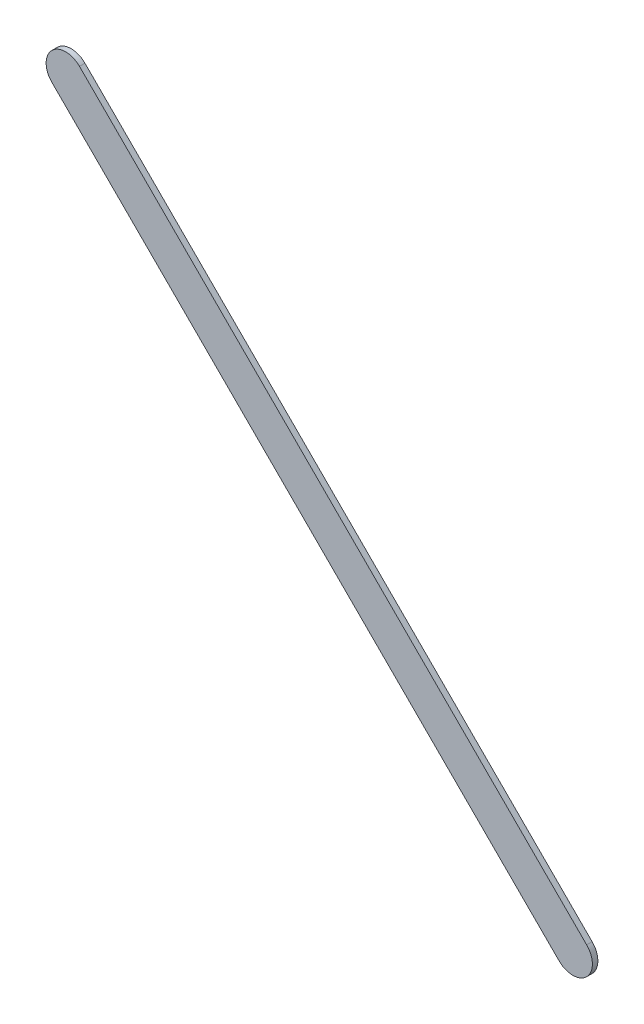
ISO-10303-21;
HEADER;
FILE_DESCRIPTION(('STEP AP214'),'2;1');
FILE_NAME('part.step','',(''),(''),'','','');
FILE_SCHEMA(('AUTOMOTIVE_DESIGN { 1 0 10303 214 1 1 1 1 }'));
ENDSEC;
DATA;
#1=APPLICATION_CONTEXT('core data for automotive mechanical design processes');
#2=APPLICATION_PROTOCOL_DEFINITION('international standard','automotive_design',2000,#1);
#3=PRODUCT_CONTEXT('',#1,'mechanical');
#4=PRODUCT('Part','Part','',(#3));
#5=PRODUCT_RELATED_PRODUCT_CATEGORY('part','',(#4));
#6=PRODUCT_DEFINITION_FORMATION('','',#4);
#7=PRODUCT_DEFINITION_CONTEXT('part definition',#1,'design');
#8=PRODUCT_DEFINITION('design','',#6,#7);
#9=PRODUCT_DEFINITION_SHAPE('','',#8);
#10=(LENGTH_UNIT() NAMED_UNIT(*) SI_UNIT(.MILLI.,.METRE.));
#11=(NAMED_UNIT(*) PLANE_ANGLE_UNIT() SI_UNIT($,.RADIAN.));
#12=(NAMED_UNIT(*) SI_UNIT($,.STERADIAN.) SOLID_ANGLE_UNIT());
#13=UNCERTAINTY_MEASURE_WITH_UNIT(LENGTH_MEASURE(1.E-05),#10,'distance_accuracy_value','');
#14=(GEOMETRIC_REPRESENTATION_CONTEXT(3) GLOBAL_UNCERTAINTY_ASSIGNED_CONTEXT((#13)) GLOBAL_UNIT_ASSIGNED_CONTEXT((#10,
#11,#12)) REPRESENTATION_CONTEXT('',''));
#15=CARTESIAN_POINT('',(0.,0.,0.));
#16=DIRECTION('',(0.,0.,1.));
#17=DIRECTION('',(1.,0.,0.));
#18=AXIS2_PLACEMENT_3D('',#15,#16,#17);
#19=CARTESIAN_POINT('',(79.42716906,54.19716872,0.));
#20=DIRECTION('',(0.707106781186548,0.707106781186548,0.));
#21=DIRECTION('',(0.707106781186548,-0.707106781186548,0.));
#22=AXIS2_PLACEMENT_3D('',#19,#20,#21);
#23=PLANE('',#22);
#24=DIRECTION('',(0.707106781186548,-0.707106781186548,0.));
#25=VECTOR('',#24,1.);
#26=CARTESIAN_POINT('',(79.42716906,54.19716872,0.03556));
#27=LINE('',#26,#25);
#28=CARTESIAN_POINT('',(79.42716906,54.19716872,0.03556));
#29=VERTEX_POINT('',#28);
#30=CARTESIAN_POINT('',(82.72717008,50.8971677,0.03556));
#31=VERTEX_POINT('',#30);
#32=EDGE_CURVE('E11',#29,#31,#27,.T.);
#33=ORIENTED_EDGE('',*,*,#32,.F.);
#34=DIRECTION('',(0.,0.,1.));
#35=VECTOR('',#34,1.);
#36=CARTESIAN_POINT('',(79.42716906,54.19716872,0.));
#37=LINE('',#36,#35);
#38=CARTESIAN_POINT('',(79.42716906,54.19716872,0.));
#39=VERTEX_POINT('',#38);
#40=EDGE_CURVE('E24',#39,#29,#37,.T.);
#41=ORIENTED_EDGE('',*,*,#40,.F.);
#42=DIRECTION('',(0.707106781186548,-0.707106781186548,0.));
#43=VECTOR('',#42,1.);
#44=CARTESIAN_POINT('',(79.42716906,54.19716872,0.));
#45=LINE('',#44,#43);
#46=CARTESIAN_POINT('',(82.72717008,50.8971677,0.));
#47=VERTEX_POINT('',#46);
#48=EDGE_CURVE('E75',#39,#47,#45,.T.);
#49=ORIENTED_EDGE('',*,*,#48,.T.);
#50=DIRECTION('',(0.,0.,1.));
#51=VECTOR('',#50,1.);
#52=CARTESIAN_POINT('',(82.72717008,50.8971677,0.));
#53=LINE('',#52,#51);
#54=EDGE_CURVE('E37',#47,#31,#53,.T.);
#55=ORIENTED_EDGE('',*,*,#54,.T.);
#56=EDGE_LOOP('',(#33,#41,#49,#55));
#57=FACE_BOUND('',#56,.T.);
#58=ADVANCED_FACE('F17',(#57),#23,.F.);
#59=CARTESIAN_POINT('',(82.81697305,50.98697067,0.));
#60=DIRECTION('',(0.,0.,-1.));
#61=DIRECTION('',(-0.707106781186576,-0.70710678118652,0.));
#62=AXIS2_PLACEMENT_3D('',#59,#60,#61);
#63=CYLINDRICAL_SURFACE('',#62,0.127000578115384);
#64=CARTESIAN_POINT('',(82.81697305,50.98697067,0.03556));
#65=DIRECTION('',(0.,0.,1.));
#66=DIRECTION('',(-0.707106781186576,-0.70710678118652,0.));
#67=AXIS2_PLACEMENT_3D('',#64,#65,#66);
#68=CIRCLE('',#67,0.127000578115384);
#69=CARTESIAN_POINT('',(82.90677602,51.07677364,0.03556));
#70=VERTEX_POINT('',#69);
#71=EDGE_CURVE('E83',#31,#70,#68,.T.);
#72=ORIENTED_EDGE('',*,*,#71,.F.);
#73=ORIENTED_EDGE('',*,*,#54,.F.);
#74=CARTESIAN_POINT('',(82.81697305,50.98697067,0.));
#75=DIRECTION('',(0.,0.,1.));
#76=DIRECTION('',(-0.707106781186576,-0.70710678118652,0.));
#77=AXIS2_PLACEMENT_3D('',#74,#75,#76);
#78=CIRCLE('',#77,0.127000578115384);
#79=CARTESIAN_POINT('',(82.90677602,51.07677364,0.));
#80=VERTEX_POINT('',#79);
#81=EDGE_CURVE('E81',#47,#80,#78,.T.);
#82=ORIENTED_EDGE('',*,*,#81,.T.);
#83=DIRECTION('',(0.,0.,1.));
#84=VECTOR('',#83,1.);
#85=CARTESIAN_POINT('',(82.90677602,51.07677364,0.));
#86=LINE('',#85,#84);
#87=EDGE_CURVE('E67',#80,#70,#86,.T.);
#88=ORIENTED_EDGE('',*,*,#87,.T.);
#89=EDGE_LOOP('',(#72,#73,#82,#88));
#90=FACE_BOUND('',#89,.T.);
#91=ADVANCED_FACE('F89',(#90),#63,.T.);
#92=CARTESIAN_POINT('',(82.90677602,51.07677364,0.));
#93=DIRECTION('',(-0.707106781186548,-0.707106781186548,0.));
#94=DIRECTION('',(-0.707106781186548,0.707106781186548,0.));
#95=AXIS2_PLACEMENT_3D('',#92,#93,#94);
#96=PLANE('',#95);
#97=DIRECTION('',(-0.707106781186548,0.707106781186548,0.));
#98=VECTOR('',#97,1.);
#99=CARTESIAN_POINT('',(82.90677602,51.07677364,0.03556));
#100=LINE('',#99,#98);
#101=CARTESIAN_POINT('',(79.606775,54.37677466,0.03556));
#102=VERTEX_POINT('',#101);
#103=EDGE_CURVE('E71',#70,#102,#100,.T.);
#104=ORIENTED_EDGE('',*,*,#103,.F.);
#105=ORIENTED_EDGE('',*,*,#87,.F.);
#106=DIRECTION('',(-0.707106781186548,0.707106781186548,0.));
#107=VECTOR('',#106,1.);
#108=CARTESIAN_POINT('',(82.90677602,51.07677364,0.));
#109=LINE('',#108,#107);
#110=CARTESIAN_POINT('',(79.606775,54.37677466,0.));
#111=VERTEX_POINT('',#110);
#112=EDGE_CURVE('E63',#80,#111,#109,.T.);
#113=ORIENTED_EDGE('',*,*,#112,.T.);
#114=DIRECTION('',(0.,0.,1.));
#115=VECTOR('',#114,1.);
#116=CARTESIAN_POINT('',(79.606775,54.37677466,0.));
#117=LINE('',#116,#115);
#118=EDGE_CURVE('E53',#111,#102,#117,.T.);
#119=ORIENTED_EDGE('',*,*,#118,.T.);
#120=EDGE_LOOP('',(#104,#105,#113,#119));
#121=FACE_BOUND('',#120,.T.);
#122=ADVANCED_FACE('F66',(#121),#96,.F.);
#123=CARTESIAN_POINT('',(79.51697203,54.28697169,0.));
#124=DIRECTION('',(0.,0.,-1.));
#125=DIRECTION('',(0.70710678118652,0.707106781186576,0.));
#126=AXIS2_PLACEMENT_3D('',#123,#124,#125);
#127=CYLINDRICAL_SURFACE('',#126,0.127000578115387);
#128=CARTESIAN_POINT('',(79.51697203,54.28697169,0.03556));
#129=DIRECTION('',(0.,0.,1.));
#130=DIRECTION('',(0.70710678118652,0.707106781186576,0.));
#131=AXIS2_PLACEMENT_3D('',#128,#129,#130);
#132=CIRCLE('',#131,0.127000578115387);
#133=EDGE_CURVE('E59',#102,#29,#132,.T.);
#134=ORIENTED_EDGE('',*,*,#133,.F.);
#135=ORIENTED_EDGE('',*,*,#118,.F.);
#136=CARTESIAN_POINT('',(79.51697203,54.28697169,0.));
#137=DIRECTION('',(0.,0.,1.));
#138=DIRECTION('',(0.70710678118652,0.707106781186576,0.));
#139=AXIS2_PLACEMENT_3D('',#136,#137,#138);
#140=CIRCLE('',#139,0.127000578115387);
#141=EDGE_CURVE('E57',#111,#39,#140,.T.);
#142=ORIENTED_EDGE('',*,*,#141,.T.);
#143=ORIENTED_EDGE('',*,*,#40,.T.);
#144=EDGE_LOOP('',(#134,#135,#142,#143));
#145=FACE_BOUND('',#144,.T.);
#146=ADVANCED_FACE('F55',(#145),#127,.T.);
#147=CARTESIAN_POINT('',(79.42716906,54.19716872,0.));
#148=DIRECTION('',(0.,0.,-1.));
#149=DIRECTION('',(-1.,0.,0.));
#150=AXIS2_PLACEMENT_3D('',#147,#148,#149);
#151=PLANE('',#150);
#152=ORIENTED_EDGE('',*,*,#141,.F.);
#153=ORIENTED_EDGE('',*,*,#112,.F.);
#154=ORIENTED_EDGE('',*,*,#81,.F.);
#155=ORIENTED_EDGE('',*,*,#48,.F.);
#156=EDGE_LOOP('',(#152,#153,#154,#155));
#157=FACE_BOUND('',#156,.T.);
#158=ADVANCED_FACE('F74',(#157),#151,.T.);
#159=CARTESIAN_POINT('',(79.42716906,54.19716872,0.03556));
#160=DIRECTION('',(0.,0.,-1.));
#161=DIRECTION('',(-1.,0.,0.));
#162=AXIS2_PLACEMENT_3D('',#159,#160,#161);
#163=PLANE('',#162);
#164=ORIENTED_EDGE('',*,*,#32,.T.);
#165=ORIENTED_EDGE('',*,*,#71,.T.);
#166=ORIENTED_EDGE('',*,*,#103,.T.);
#167=ORIENTED_EDGE('',*,*,#133,.T.);
#168=EDGE_LOOP('',(#164,#165,#166,#167));
#169=FACE_BOUND('',#168,.T.);
#170=ADVANCED_FACE('F91',(#169),#163,.F.);
#171=CLOSED_SHELL('',(#58,#91,#122,#146,#158,#170));
#172=MANIFOLD_SOLID_BREP('B1',#171);
#173=ADVANCED_BREP_SHAPE_REPRESENTATION('',(#18,#172),#14);
#174=SHAPE_DEFINITION_REPRESENTATION(#9,#173);
ENDSEC;
END-ISO-10303-21;
